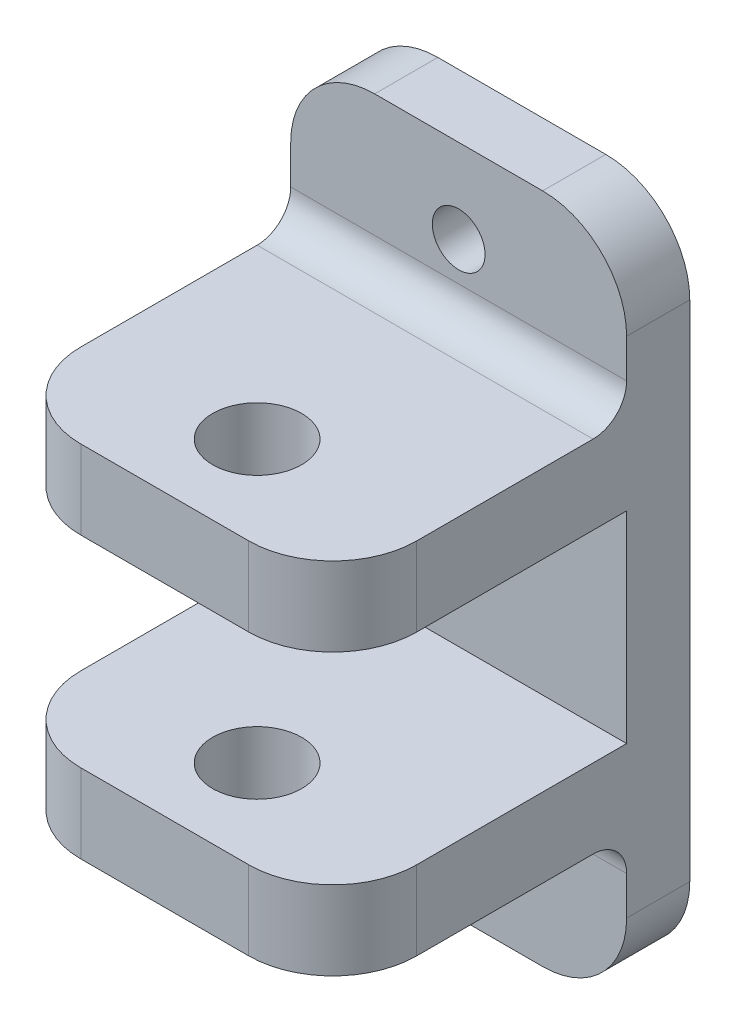
ISO-10303-21;
HEADER;
FILE_DESCRIPTION(('STEP AP214'),'2;1');
FILE_NAME('part.step','',(''),(''),'','','');
FILE_SCHEMA(('AUTOMOTIVE_DESIGN { 1 0 10303 214 1 1 1 1 }'));
ENDSEC;
DATA;
#1=APPLICATION_CONTEXT('core data for automotive mechanical design processes');
#2=APPLICATION_PROTOCOL_DEFINITION('international standard','automotive_design',2000,#1);
#3=PRODUCT_CONTEXT('',#1,'mechanical');
#4=PRODUCT('Part','Part','',(#3));
#5=PRODUCT_RELATED_PRODUCT_CATEGORY('part','',(#4));
#6=PRODUCT_DEFINITION_FORMATION('','',#4);
#7=PRODUCT_DEFINITION_CONTEXT('part definition',#1,'design');
#8=PRODUCT_DEFINITION('design','',#6,#7);
#9=PRODUCT_DEFINITION_SHAPE('','',#8);
#10=(LENGTH_UNIT() NAMED_UNIT(*) SI_UNIT(.MILLI.,.METRE.));
#11=(NAMED_UNIT(*) PLANE_ANGLE_UNIT() SI_UNIT($,.RADIAN.));
#12=(NAMED_UNIT(*) SI_UNIT($,.STERADIAN.) SOLID_ANGLE_UNIT());
#13=UNCERTAINTY_MEASURE_WITH_UNIT(LENGTH_MEASURE(1.E-05),#10,'distance_accuracy_value','');
#14=(GEOMETRIC_REPRESENTATION_CONTEXT(3) GLOBAL_UNCERTAINTY_ASSIGNED_CONTEXT((#13)) GLOBAL_UNIT_ASSIGNED_CONTEXT((#10,
#11,#12)) REPRESENTATION_CONTEXT('',''));
#15=CARTESIAN_POINT('',(0.,0.,0.));
#16=DIRECTION('',(0.,0.,1.));
#17=DIRECTION('',(1.,0.,0.));
#18=AXIS2_PLACEMENT_3D('',#15,#16,#17);
#19=CARTESIAN_POINT('',(0.,0.,4.7752));
#20=DIRECTION('',(0.,0.,1.));
#21=DIRECTION('',(0.,-1.,0.));
#22=AXIS2_PLACEMENT_3D('',#19,#20,#21);
#23=PLANE('',#22);
#24=DIRECTION('',(1.,0.,0.));
#25=VECTOR('',#24,1.);
#26=CARTESIAN_POINT('',(0.,24.13,4.7752));
#27=LINE('',#26,#25);
#28=CARTESIAN_POINT('',(-25.4,24.13,4.7752));
#29=VERTEX_POINT('',#28);
#30=CARTESIAN_POINT('',(0.,24.13,4.7752));
#31=VERTEX_POINT('',#30);
#32=EDGE_CURVE('E392',#29,#31,#27,.T.);
#33=ORIENTED_EDGE('',*,*,#32,.T.);
#34=DIRECTION('',(0.,-1.,0.));
#35=VECTOR('',#34,1.);
#36=CARTESIAN_POINT('',(0.,63.5,4.7752));
#37=LINE('',#36,#35);
#38=CARTESIAN_POINT('',(0.,39.37,4.7752));
#39=VERTEX_POINT('',#38);
#40=EDGE_CURVE('E355',#39,#31,#37,.T.);
#41=ORIENTED_EDGE('',*,*,#40,.F.);
#42=DIRECTION('',(-1.,0.,0.));
#43=VECTOR('',#42,1.);
#44=CARTESIAN_POINT('',(-12.7,39.37,4.7752));
#45=LINE('',#44,#43);
#46=CARTESIAN_POINT('',(-25.4,39.37,4.7752));
#47=VERTEX_POINT('',#46);
#48=EDGE_CURVE('E25',#39,#47,#45,.T.);
#49=ORIENTED_EDGE('',*,*,#48,.T.);
#50=DIRECTION('',(0.,1.,0.));
#51=VECTOR('',#50,1.);
#52=CARTESIAN_POINT('',(-25.4,63.5,4.7752));
#53=LINE('',#52,#51);
#54=EDGE_CURVE('E450',#29,#47,#53,.T.);
#55=ORIENTED_EDGE('',*,*,#54,.F.);
#56=EDGE_LOOP('',(#33,#41,#49,#55));
#57=FACE_BOUND('',#56,.T.);
#58=ADVANCED_FACE('F17',(#57),#23,.T.);
#59=CARTESIAN_POINT('',(-12.7,42.3545,27.0002));
#60=DIRECTION('',(0.,0.,1.));
#61=DIRECTION('',(1.,0.,0.));
#62=AXIS2_PLACEMENT_3D('',#59,#60,#61);
#63=PLANE('',#62);
#64=DIRECTION('',(0.,1.,0.));
#65=VECTOR('',#64,1.);
#66=CARTESIAN_POINT('',(-19.05,37.05225,27.0002));
#67=LINE('',#66,#65);
#68=CARTESIAN_POINT('',(-19.05,39.37,27.0002));
#69=VERTEX_POINT('',#68);
#70=CARTESIAN_POINT('',(-19.05,45.339,27.0002));
#71=VERTEX_POINT('',#70);
#72=EDGE_CURVE('E364',#69,#71,#67,.T.);
#73=ORIENTED_EDGE('',*,*,#72,.F.);
#74=DIRECTION('',(1.,0.,0.));
#75=VECTOR('',#74,1.);
#76=CARTESIAN_POINT('',(-25.4,39.37,27.0002));
#77=LINE('',#76,#75);
#78=CARTESIAN_POINT('',(-6.35,39.37,27.0002));
#79=VERTEX_POINT('',#78);
#80=EDGE_CURVE('E11',#69,#79,#77,.T.);
#81=ORIENTED_EDGE('',*,*,#80,.T.);
#82=DIRECTION('',(0.,-1.,0.));
#83=VECTOR('',#82,1.);
#84=CARTESIAN_POINT('',(-6.35,37.05225,27.0002));
#85=LINE('',#84,#83);
#86=CARTESIAN_POINT('',(-6.35,45.339,27.0002));
#87=VERTEX_POINT('',#86);
#88=EDGE_CURVE('E334',#87,#79,#85,.T.);
#89=ORIENTED_EDGE('',*,*,#88,.F.);
#90=DIRECTION('',(-1.,0.,0.));
#91=VECTOR('',#90,1.);
#92=CARTESIAN_POINT('',(0.,45.339,27.0002));
#93=LINE('',#92,#91);
#94=EDGE_CURVE('E347',#87,#71,#93,.T.);
#95=ORIENTED_EDGE('',*,*,#94,.T.);
#96=EDGE_LOOP('',(#73,#81,#89,#95));
#97=FACE_BOUND('',#96,.T.);
#98=ADVANCED_FACE('F608',(#97),#63,.T.);
#99=CARTESIAN_POINT('',(-25.4,39.37,4.7752));
#100=DIRECTION('',(0.,-1.,0.));
#101=DIRECTION('',(0.,0.,-1.));
#102=AXIS2_PLACEMENT_3D('',#99,#100,#101);
#103=PLANE('',#102);
#104=CARTESIAN_POINT('',(-12.7,39.37,20.0152));
#105=DIRECTION('',(0.,1.,0.));
#106=DIRECTION('',(1.,0.,0.));
#107=AXIS2_PLACEMENT_3D('',#104,#105,#106);
#108=CIRCLE('',#107,3.3655);
#109=CARTESIAN_POINT('',(-16.0655,39.37,20.0152));
#110=VERTEX_POINT('',#109);
#111=EDGE_CURVE('E45',#110,#110,#108,.T.);
#112=ORIENTED_EDGE('',*,*,#111,.T.);
#113=EDGE_LOOP('',(#112));
#114=FACE_BOUND('',#113,.T.);
#115=CARTESIAN_POINT('',(-19.05,39.37,20.6502));
#116=DIRECTION('',(0.,1.,0.));
#117=DIRECTION('',(-0.707106781186548,0.,0.707106781186547));
#118=AXIS2_PLACEMENT_3D('',#115,#116,#117);
#119=CIRCLE('',#118,6.35);
#120=CARTESIAN_POINT('',(-25.4,39.37,20.6502));
#121=VERTEX_POINT('',#120);
#122=EDGE_CURVE('E406',#121,#69,#119,.T.);
#123=ORIENTED_EDGE('',*,*,#122,.F.);
#124=DIRECTION('',(0.,0.,1.));
#125=VECTOR('',#124,1.);
#126=CARTESIAN_POINT('',(-25.4,39.37,4.7752));
#127=LINE('',#126,#125);
#128=EDGE_CURVE('E339',#47,#121,#127,.T.);
#129=ORIENTED_EDGE('',*,*,#128,.F.);
#130=ORIENTED_EDGE('',*,*,#48,.F.);
#131=DIRECTION('',(0.,0.,1.));
#132=VECTOR('',#131,1.);
#133=CARTESIAN_POINT('',(0.,39.37,4.7752));
#134=LINE('',#133,#132);
#135=CARTESIAN_POINT('',(0.,39.37,20.6502));
#136=VERTEX_POINT('',#135);
#137=EDGE_CURVE('E476',#39,#136,#134,.T.);
#138=ORIENTED_EDGE('',*,*,#137,.T.);
#139=CARTESIAN_POINT('',(-6.35,39.37,20.6502));
#140=DIRECTION('',(0.,1.,0.));
#141=DIRECTION('',(0.707106781186548,0.,0.707106781186547));
#142=AXIS2_PLACEMENT_3D('',#139,#140,#141);
#143=CIRCLE('',#142,6.35);
#144=EDGE_CURVE('E338',#79,#136,#143,.T.);
#145=ORIENTED_EDGE('',*,*,#144,.F.);
#146=ORIENTED_EDGE('',*,*,#80,.F.);
#147=EDGE_LOOP('',(#123,#129,#130,#138,#145,#146));
#148=FACE_BOUND('',#147,.T.);
#149=ADVANCED_FACE('F552',(#114,#148),#103,.T.);
#150=CARTESIAN_POINT('',(-12.7,21.1455,27.0002));
#151=DIRECTION('',(0.,0.,1.));
#152=DIRECTION('',(0.,-1.,0.));
#153=AXIS2_PLACEMENT_3D('',#150,#151,#152);
#154=PLANE('',#153);
#155=DIRECTION('',(0.,-1.,0.));
#156=VECTOR('',#155,1.);
#157=CARTESIAN_POINT('',(-6.35,26.44775,27.0002));
#158=LINE('',#157,#156);
#159=CARTESIAN_POINT('',(-6.35,24.13,27.0002));
#160=VERTEX_POINT('',#159);
#161=CARTESIAN_POINT('',(-6.35,18.161,27.0002));
#162=VERTEX_POINT('',#161);
#163=EDGE_CURVE('E418',#160,#162,#158,.T.);
#164=ORIENTED_EDGE('',*,*,#163,.F.);
#165=DIRECTION('',(-1.,0.,0.));
#166=VECTOR('',#165,1.);
#167=CARTESIAN_POINT('',(0.,24.13,27.0002));
#168=LINE('',#167,#166);
#169=CARTESIAN_POINT('',(-19.05,24.13,27.0002));
#170=VERTEX_POINT('',#169);
#171=EDGE_CURVE('E389',#160,#170,#168,.T.);
#172=ORIENTED_EDGE('',*,*,#171,.T.);
#173=DIRECTION('',(0.,1.,0.));
#174=VECTOR('',#173,1.);
#175=CARTESIAN_POINT('',(-19.05,26.44775,27.0002));
#176=LINE('',#175,#174);
#177=CARTESIAN_POINT('',(-19.05,18.161,27.0002));
#178=VERTEX_POINT('',#177);
#179=EDGE_CURVE('E421',#178,#170,#176,.T.);
#180=ORIENTED_EDGE('',*,*,#179,.F.);
#181=DIRECTION('',(1.,0.,0.));
#182=VECTOR('',#181,1.);
#183=CARTESIAN_POINT('',(-25.4,18.161,27.0002));
#184=LINE('',#183,#182);
#185=EDGE_CURVE('E297',#178,#162,#184,.T.);
#186=ORIENTED_EDGE('',*,*,#185,.T.);
#187=EDGE_LOOP('',(#164,#172,#180,#186));
#188=FACE_BOUND('',#187,.T.);
#189=ADVANCED_FACE('F564',(#188),#154,.T.);
#190=CARTESIAN_POINT('',(0.,24.13,4.7752));
#191=DIRECTION('',(0.,1.,0.));
#192=DIRECTION('',(0.,0.,-1.));
#193=AXIS2_PLACEMENT_3D('',#190,#191,#192);
#194=PLANE('',#193);
#195=CARTESIAN_POINT('',(-12.7,24.13,20.0152));
#196=DIRECTION('',(0.,-1.,0.));
#197=DIRECTION('',(1.,0.,0.));
#198=AXIS2_PLACEMENT_3D('',#195,#196,#197);
#199=CIRCLE('',#198,3.3655);
#200=CARTESIAN_POINT('',(-16.0655,24.13,20.0152));
#201=VERTEX_POINT('',#200);
#202=EDGE_CURVE('E290',#201,#201,#199,.T.);
#203=ORIENTED_EDGE('',*,*,#202,.T.);
#204=EDGE_LOOP('',(#203));
#205=FACE_BOUND('',#204,.T.);
#206=CARTESIAN_POINT('',(-6.35,24.13,20.6502));
#207=DIRECTION('',(0.,-1.,0.));
#208=DIRECTION('',(0.707106781186548,0.,0.707106781186547));
#209=AXIS2_PLACEMENT_3D('',#206,#207,#208);
#210=CIRCLE('',#209,6.35);
#211=CARTESIAN_POINT('',(0.,24.13,20.6502));
#212=VERTEX_POINT('',#211);
#213=EDGE_CURVE('E379',#212,#160,#210,.T.);
#214=ORIENTED_EDGE('',*,*,#213,.F.);
#215=DIRECTION('',(0.,0.,1.));
#216=VECTOR('',#215,1.);
#217=CARTESIAN_POINT('',(0.,24.13,4.7752));
#218=LINE('',#217,#216);
#219=EDGE_CURVE('E351',#31,#212,#218,.T.);
#220=ORIENTED_EDGE('',*,*,#219,.F.);
#221=ORIENTED_EDGE('',*,*,#32,.F.);
#222=DIRECTION('',(0.,0.,1.));
#223=VECTOR('',#222,1.);
#224=CARTESIAN_POINT('',(-25.4,24.13,4.7752));
#225=LINE('',#224,#223);
#226=CARTESIAN_POINT('',(-25.4,24.13,20.6502));
#227=VERTEX_POINT('',#226);
#228=EDGE_CURVE('E306',#29,#227,#225,.T.);
#229=ORIENTED_EDGE('',*,*,#228,.T.);
#230=CARTESIAN_POINT('',(-19.05,24.13,20.6502));
#231=DIRECTION('',(0.,-1.,0.));
#232=DIRECTION('',(-0.707106781186548,0.,0.707106781186547));
#233=AXIS2_PLACEMENT_3D('',#230,#231,#232);
#234=CIRCLE('',#233,6.35);
#235=EDGE_CURVE('E458',#170,#227,#234,.T.);
#236=ORIENTED_EDGE('',*,*,#235,.F.);
#237=ORIENTED_EDGE('',*,*,#171,.F.);
#238=EDGE_LOOP('',(#214,#220,#221,#229,#236,#237));
#239=FACE_BOUND('',#238,.T.);
#240=ADVANCED_FACE('F548',(#205,#239),#194,.T.);
#241=CARTESIAN_POINT('',(-12.7,50.8,4.7752));
#242=DIRECTION('',(0.,0.,-1.));
#243=DIRECTION('',(1.,0.,0.));
#244=AXIS2_PLACEMENT_3D('',#241,#242,#243);
#245=CYLINDRICAL_SURFACE('',#244,1.9939);
#246=CARTESIAN_POINT('',(-12.7,50.8,4.7752));
#247=DIRECTION('',(0.,0.,-1.));
#248=DIRECTION('',(1.,0.,0.));
#249=AXIS2_PLACEMENT_3D('',#246,#247,#248);
#250=CIRCLE('',#249,1.9939);
#251=CARTESIAN_POINT('',(-14.6939,50.8,4.7752));
#252=VERTEX_POINT('',#251);
#253=EDGE_CURVE('E430',#252,#252,#250,.T.);
#254=ORIENTED_EDGE('',*,*,#253,.F.);
#255=DIRECTION('',(0.,0.,-1.));
#256=VECTOR('',#255,1.);
#257=CARTESIAN_POINT('',(-14.6939,50.8,4.7752));
#258=LINE('',#257,#256);
#259=CARTESIAN_POINT('',(-14.6939,50.8,0.));
#260=VERTEX_POINT('',#259);
#261=EDGE_CURVE('E536',#252,#260,#258,.T.);
#262=ORIENTED_EDGE('',*,*,#261,.T.);
#263=CARTESIAN_POINT('',(-12.7,50.8,0.));
#264=DIRECTION('',(0.,0.,1.));
#265=DIRECTION('',(1.,0.,0.));
#266=AXIS2_PLACEMENT_3D('',#263,#264,#265);
#267=CIRCLE('',#266,1.9939);
#268=EDGE_CURVE('E457',#260,#260,#267,.T.);
#269=ORIENTED_EDGE('',*,*,#268,.F.);
#270=ORIENTED_EDGE('',*,*,#261,.F.);
#271=EDGE_LOOP('',(#254,#262,#269,#270));
#272=FACE_BOUND('',#271,.T.);
#273=ADVANCED_FACE('F646',(#272),#245,.F.);
#274=CARTESIAN_POINT('',(-12.7,12.7,4.7752));
#275=DIRECTION('',(0.,0.,-1.));
#276=DIRECTION('',(1.,0.,0.));
#277=AXIS2_PLACEMENT_3D('',#274,#275,#276);
#278=CYLINDRICAL_SURFACE('',#277,1.9939);
#279=CARTESIAN_POINT('',(-12.7,12.7,4.7752));
#280=DIRECTION('',(0.,0.,-1.));
#281=DIRECTION('',(1.,0.,0.));
#282=AXIS2_PLACEMENT_3D('',#279,#280,#281);
#283=CIRCLE('',#282,1.9939);
#284=CARTESIAN_POINT('',(-14.6939,12.7,4.7752));
#285=VERTEX_POINT('',#284);
#286=EDGE_CURVE('E451',#285,#285,#283,.T.);
#287=ORIENTED_EDGE('',*,*,#286,.F.);
#288=DIRECTION('',(0.,0.,-1.));
#289=VECTOR('',#288,1.);
#290=CARTESIAN_POINT('',(-14.6939,12.7,4.7752));
#291=LINE('',#290,#289);
#292=CARTESIAN_POINT('',(-14.6939,12.7,0.));
#293=VERTEX_POINT('',#292);
#294=EDGE_CURVE('E289',#285,#293,#291,.T.);
#295=ORIENTED_EDGE('',*,*,#294,.T.);
#296=CARTESIAN_POINT('',(-12.7,12.7,0.));
#297=DIRECTION('',(0.,0.,1.));
#298=DIRECTION('',(1.,0.,0.));
#299=AXIS2_PLACEMENT_3D('',#296,#297,#298);
#300=CIRCLE('',#299,1.9939);
#301=EDGE_CURVE('E514',#293,#293,#300,.T.);
#302=ORIENTED_EDGE('',*,*,#301,.F.);
#303=ORIENTED_EDGE('',*,*,#294,.F.);
#304=EDGE_LOOP('',(#287,#295,#302,#303));
#305=FACE_BOUND('',#304,.T.);
#306=ADVANCED_FACE('F648',(#305),#278,.F.);
#307=CARTESIAN_POINT('',(-12.7,45.339,20.0152));
#308=DIRECTION('',(0.,-1.,0.));
#309=DIRECTION('',(1.,0.,0.));
#310=AXIS2_PLACEMENT_3D('',#307,#308,#309);
#311=CYLINDRICAL_SURFACE('',#310,3.3655);
#312=ORIENTED_EDGE('',*,*,#202,.F.);
#313=DIRECTION('',(0.,-1.,0.));
#314=VECTOR('',#313,1.);
#315=CARTESIAN_POINT('',(-16.0655,45.339,20.0152));
#316=LINE('',#315,#314);
#317=CARTESIAN_POINT('',(-16.0655,18.161,20.0152));
#318=VERTEX_POINT('',#317);
#319=EDGE_CURVE('E37',#201,#318,#316,.T.);
#320=ORIENTED_EDGE('',*,*,#319,.T.);
#321=CARTESIAN_POINT('',(-12.7,18.161,20.0152));
#322=DIRECTION('',(0.,1.,0.));
#323=DIRECTION('',(1.,0.,0.));
#324=AXIS2_PLACEMENT_3D('',#321,#322,#323);
#325=CIRCLE('',#324,3.3655);
#326=EDGE_CURVE('E326',#318,#318,#325,.T.);
#327=ORIENTED_EDGE('',*,*,#326,.F.);
#328=ORIENTED_EDGE('',*,*,#319,.F.);
#329=EDGE_LOOP('',(#312,#320,#327,#328));
#330=FACE_BOUND('',#329,.T.);
#331=ADVANCED_FACE('F651',(#330),#311,.F.);
#332=CARTESIAN_POINT('',(-12.7,45.339,20.0152));
#333=DIRECTION('',(0.,-1.,0.));
#334=DIRECTION('',(1.,0.,0.));
#335=AXIS2_PLACEMENT_3D('',#332,#333,#334);
#336=CYLINDRICAL_SURFACE('',#335,3.3655);
#337=CARTESIAN_POINT('',(-12.7,45.339,20.0152));
#338=DIRECTION('',(0.,-1.,0.));
#339=DIRECTION('',(1.,0.,0.));
#340=AXIS2_PLACEMENT_3D('',#337,#338,#339);
#341=CIRCLE('',#340,3.3655);
#342=CARTESIAN_POINT('',(-16.0655,45.339,20.0152));
#343=VERTEX_POINT('',#342);
#344=EDGE_CURVE('E384',#343,#343,#341,.T.);
#345=ORIENTED_EDGE('',*,*,#344,.F.);
#346=DIRECTION('',(0.,-1.,0.));
#347=VECTOR('',#346,1.);
#348=CARTESIAN_POINT('',(-16.0655,45.339,20.0152));
#349=LINE('',#348,#347);
#350=EDGE_CURVE('E426',#343,#110,#349,.T.);
#351=ORIENTED_EDGE('',*,*,#350,.T.);
#352=ORIENTED_EDGE('',*,*,#111,.F.);
#353=ORIENTED_EDGE('',*,*,#350,.F.);
#354=EDGE_LOOP('',(#345,#351,#352,#353));
#355=FACE_BOUND('',#354,.T.);
#356=ADVANCED_FACE('F655',(#355),#336,.F.);
#357=CARTESIAN_POINT('',(0.,0.,4.7752));
#358=DIRECTION('',(0.,0.,1.));
#359=DIRECTION('',(0.,-1.,0.));
#360=AXIS2_PLACEMENT_3D('',#357,#358,#359);
#361=PLANE('',#360);
#362=ORIENTED_EDGE('',*,*,#253,.T.);
#363=EDGE_LOOP('',(#362));
#364=FACE_BOUND('',#363,.T.);
#365=DIRECTION('',(-1.,0.,0.));
#366=VECTOR('',#365,1.);
#367=CARTESIAN_POINT('',(0.,47.879,4.7752));
#368=LINE('',#367,#366);
#369=CARTESIAN_POINT('',(0.,47.879,4.7752));
#370=VERTEX_POINT('',#369);
#371=CARTESIAN_POINT('',(-25.4,47.879,4.7752));
#372=VERTEX_POINT('',#371);
#373=EDGE_CURVE('E315',#370,#372,#368,.T.);
#374=ORIENTED_EDGE('',*,*,#373,.F.);
#375=DIRECTION('',(0.,-1.,0.));
#376=VECTOR('',#375,1.);
#377=CARTESIAN_POINT('',(0.,63.5,4.7752));
#378=LINE('',#377,#376);
#379=CARTESIAN_POINT('',(0.,50.8,4.7752));
#380=VERTEX_POINT('',#379);
#381=EDGE_CURVE('E376',#380,#370,#378,.T.);
#382=ORIENTED_EDGE('',*,*,#381,.F.);
#383=CARTESIAN_POINT('',(-6.35,50.8,4.7752));
#384=DIRECTION('',(0.,0.,-1.));
#385=DIRECTION('',(0.707106781186548,0.707106781186547,0.));
#386=AXIS2_PLACEMENT_3D('',#383,#384,#385);
#387=CIRCLE('',#386,6.35);
#388=CARTESIAN_POINT('',(-6.35,57.15,4.7752));
#389=VERTEX_POINT('',#388);
#390=EDGE_CURVE('E287',#389,#380,#387,.T.);
#391=ORIENTED_EDGE('',*,*,#390,.F.);
#392=DIRECTION('',(-1.,0.,0.));
#393=VECTOR('',#392,1.);
#394=CARTESIAN_POINT('',(0.,57.15,4.7752));
#395=LINE('',#394,#393);
#396=CARTESIAN_POINT('',(-19.05,57.15,4.7752));
#397=VERTEX_POINT('',#396);
#398=EDGE_CURVE('E313',#389,#397,#395,.T.);
#399=ORIENTED_EDGE('',*,*,#398,.T.);
#400=CARTESIAN_POINT('',(-19.05,50.8,4.7752));
#401=DIRECTION('',(0.,0.,-1.));
#402=DIRECTION('',(-0.707106781186548,0.707106781186547,0.));
#403=AXIS2_PLACEMENT_3D('',#400,#401,#402);
#404=CIRCLE('',#403,6.35);
#405=CARTESIAN_POINT('',(-25.4,50.8,4.7752));
#406=VERTEX_POINT('',#405);
#407=EDGE_CURVE('E396',#406,#397,#404,.T.);
#408=ORIENTED_EDGE('',*,*,#407,.F.);
#409=DIRECTION('',(0.,1.,0.));
#410=VECTOR('',#409,1.);
#411=CARTESIAN_POINT('',(-25.4,63.5,4.7752));
#412=LINE('',#411,#410);
#413=EDGE_CURVE('E359',#372,#406,#412,.T.);
#414=ORIENTED_EDGE('',*,*,#413,.F.);
#415=EDGE_LOOP('',(#374,#382,#391,#399,#408,#414));
#416=FACE_BOUND('',#415,.T.);
#417=ADVANCED_FACE('F593',(#364,#416),#361,.T.);
#418=CARTESIAN_POINT('',(0.,0.,4.7752));
#419=DIRECTION('',(0.,0.,1.));
#420=DIRECTION('',(0.,-1.,0.));
#421=AXIS2_PLACEMENT_3D('',#418,#419,#420);
#422=PLANE('',#421);
#423=ORIENTED_EDGE('',*,*,#286,.T.);
#424=EDGE_LOOP('',(#423));
#425=FACE_BOUND('',#424,.T.);
#426=DIRECTION('',(1.,0.,0.));
#427=VECTOR('',#426,1.);
#428=CARTESIAN_POINT('',(-12.7,15.621,4.7752));
#429=LINE('',#428,#427);
#430=CARTESIAN_POINT('',(-25.4,15.621,4.7752));
#431=VERTEX_POINT('',#430);
#432=CARTESIAN_POINT('',(0.,15.621,4.7752));
#433=VERTEX_POINT('',#432);
#434=EDGE_CURVE('E251',#431,#433,#429,.T.);
#435=ORIENTED_EDGE('',*,*,#434,.F.);
#436=DIRECTION('',(0.,1.,0.));
#437=VECTOR('',#436,1.);
#438=CARTESIAN_POINT('',(-25.4,63.5,4.7752));
#439=LINE('',#438,#437);
#440=CARTESIAN_POINT('',(-25.4,12.7,4.7752));
#441=VERTEX_POINT('',#440);
#442=EDGE_CURVE('E307',#441,#431,#439,.T.);
#443=ORIENTED_EDGE('',*,*,#442,.F.);
#444=CARTESIAN_POINT('',(-19.05,12.7,4.7752));
#445=DIRECTION('',(0.,0.,-1.));
#446=DIRECTION('',(-0.707106781186547,-0.707106781186548,0.));
#447=AXIS2_PLACEMENT_3D('',#444,#445,#446);
#448=CIRCLE('',#447,6.35);
#449=CARTESIAN_POINT('',(-19.05,6.35,4.7752));
#450=VERTEX_POINT('',#449);
#451=EDGE_CURVE('E435',#450,#441,#448,.T.);
#452=ORIENTED_EDGE('',*,*,#451,.F.);
#453=DIRECTION('',(1.,0.,0.));
#454=VECTOR('',#453,1.);
#455=CARTESIAN_POINT('',(-12.7,6.35,4.7752));
#456=LINE('',#455,#454);
#457=CARTESIAN_POINT('',(-6.35,6.35,4.7752));
#458=VERTEX_POINT('',#457);
#459=EDGE_CURVE('E310',#450,#458,#456,.T.);
#460=ORIENTED_EDGE('',*,*,#459,.T.);
#461=CARTESIAN_POINT('',(-6.35,12.7,4.7752));
#462=DIRECTION('',(0.,0.,-1.));
#463=DIRECTION('',(0.707106781186547,-0.707106781186548,0.));
#464=AXIS2_PLACEMENT_3D('',#461,#462,#463);
#465=CIRCLE('',#464,6.35);
#466=CARTESIAN_POINT('',(0.,12.7,4.7752));
#467=VERTEX_POINT('',#466);
#468=EDGE_CURVE('E254',#467,#458,#465,.T.);
#469=ORIENTED_EDGE('',*,*,#468,.F.);
#470=DIRECTION('',(0.,-1.,0.));
#471=VECTOR('',#470,1.);
#472=CARTESIAN_POINT('',(0.,63.5,4.7752));
#473=LINE('',#472,#471);
#474=EDGE_CURVE('E247',#433,#467,#473,.T.);
#475=ORIENTED_EDGE('',*,*,#474,.F.);
#476=EDGE_LOOP('',(#435,#443,#452,#460,#469,#475));
#477=FACE_BOUND('',#476,.T.);
#478=ADVANCED_FACE('F249',(#425,#477),#422,.T.);
#479=CARTESIAN_POINT('',(0.,57.15,4.7752));
#480=DIRECTION('',(0.,-1.,0.));
#481=DIRECTION('',(0.,0.,-1.));
#482=AXIS2_PLACEMENT_3D('',#479,#480,#481);
#483=PLANE('',#482);
#484=DIRECTION('',(0.,0.,-1.));
#485=VECTOR('',#484,1.);
#486=CARTESIAN_POINT('',(-19.05,57.15,3.5814));
#487=LINE('',#486,#485);
#488=CARTESIAN_POINT('',(-19.05,57.15,0.));
#489=VERTEX_POINT('',#488);
#490=EDGE_CURVE('E393',#397,#489,#487,.T.);
#491=ORIENTED_EDGE('',*,*,#490,.F.);
#492=ORIENTED_EDGE('',*,*,#398,.F.);
#493=DIRECTION('',(0.,0.,1.));
#494=VECTOR('',#493,1.);
#495=CARTESIAN_POINT('',(-6.35,57.15,3.5814));
#496=LINE('',#495,#494);
#497=CARTESIAN_POINT('',(-6.35,57.15,0.));
#498=VERTEX_POINT('',#497);
#499=EDGE_CURVE('E314',#498,#389,#496,.T.);
#500=ORIENTED_EDGE('',*,*,#499,.F.);
#501=DIRECTION('',(1.,0.,0.));
#502=VECTOR('',#501,1.);
#503=CARTESIAN_POINT('',(0.,57.15,0.));
#504=LINE('',#503,#502);
#505=EDGE_CURVE('E467',#489,#498,#504,.T.);
#506=ORIENTED_EDGE('',*,*,#505,.F.);
#507=EDGE_LOOP('',(#491,#492,#500,#506));
#508=FACE_BOUND('',#507,.T.);
#509=ADVANCED_FACE('F617',(#508),#483,.F.);
#510=CARTESIAN_POINT('',(-25.4,6.35,4.7752));
#511=DIRECTION('',(0.,1.,0.));
#512=DIRECTION('',(0.,0.,-1.));
#513=AXIS2_PLACEMENT_3D('',#510,#511,#512);
#514=PLANE('',#513);
#515=DIRECTION('',(0.,0.,-1.));
#516=VECTOR('',#515,1.);
#517=CARTESIAN_POINT('',(-6.35,6.35,3.5814));
#518=LINE('',#517,#516);
#519=CARTESIAN_POINT('',(-6.35,6.35,0.));
#520=VERTEX_POINT('',#519);
#521=EDGE_CURVE('E402',#458,#520,#518,.T.);
#522=ORIENTED_EDGE('',*,*,#521,.F.);
#523=ORIENTED_EDGE('',*,*,#459,.F.);
#524=DIRECTION('',(0.,0.,1.));
#525=VECTOR('',#524,1.);
#526=CARTESIAN_POINT('',(-19.05,6.35,3.5814));
#527=LINE('',#526,#525);
#528=CARTESIAN_POINT('',(-19.05,6.35,0.));
#529=VERTEX_POINT('',#528);
#530=EDGE_CURVE('E431',#529,#450,#527,.T.);
#531=ORIENTED_EDGE('',*,*,#530,.F.);
#532=DIRECTION('',(-1.,0.,0.));
#533=VECTOR('',#532,1.);
#534=CARTESIAN_POINT('',(-12.7,6.35,0.));
#535=LINE('',#534,#533);
#536=EDGE_CURVE('E397',#520,#529,#535,.T.);
#537=ORIENTED_EDGE('',*,*,#536,.F.);
#538=EDGE_LOOP('',(#522,#523,#531,#537));
#539=FACE_BOUND('',#538,.T.);
#540=ADVANCED_FACE('F576',(#539),#514,.F.);
#541=CARTESIAN_POINT('',(-6.35,50.8,3.5814));
#542=DIRECTION('',(0.,0.,1.));
#543=DIRECTION('',(0.707106781186548,0.707106781186547,0.));
#544=AXIS2_PLACEMENT_3D('',#541,#542,#543);
#545=CYLINDRICAL_SURFACE('',#544,6.35);
#546=ORIENTED_EDGE('',*,*,#390,.T.);
#547=DIRECTION('',(0.,0.,-1.));
#548=VECTOR('',#547,1.);
#549=CARTESIAN_POINT('',(0.,50.8,3.5814));
#550=LINE('',#549,#548);
#551=CARTESIAN_POINT('',(0.,50.8,0.));
#552=VERTEX_POINT('',#551);
#553=EDGE_CURVE('E380',#380,#552,#550,.T.);
#554=ORIENTED_EDGE('',*,*,#553,.T.);
#555=CARTESIAN_POINT('',(-6.35,50.8,0.));
#556=DIRECTION('',(0.,0.,1.));
#557=DIRECTION('',(0.707106781186548,0.707106781186547,0.));
#558=AXIS2_PLACEMENT_3D('',#555,#556,#557);
#559=CIRCLE('',#558,6.35);
#560=EDGE_CURVE('E471',#552,#498,#559,.T.);
#561=ORIENTED_EDGE('',*,*,#560,.T.);
#562=ORIENTED_EDGE('',*,*,#499,.T.);
#563=EDGE_LOOP('',(#546,#554,#561,#562));
#564=FACE_BOUND('',#563,.T.);
#565=ADVANCED_FACE('F587',(#564),#545,.T.);
#566=CARTESIAN_POINT('',(-19.05,50.8,3.5814));
#567=DIRECTION('',(0.,0.,-1.));
#568=DIRECTION('',(-0.707106781186548,0.707106781186547,0.));
#569=AXIS2_PLACEMENT_3D('',#566,#567,#568);
#570=CYLINDRICAL_SURFACE('',#569,6.35);
#571=CARTESIAN_POINT('',(-19.05,50.8,0.));
#572=DIRECTION('',(0.,0.,1.));
#573=DIRECTION('',(-0.707106781186548,0.707106781186547,0.));
#574=AXIS2_PLACEMENT_3D('',#571,#572,#573);
#575=CIRCLE('',#574,6.35);
#576=CARTESIAN_POINT('',(-25.4,50.8,0.));
#577=VERTEX_POINT('',#576);
#578=EDGE_CURVE('E472',#489,#577,#575,.T.);
#579=ORIENTED_EDGE('',*,*,#578,.T.);
#580=DIRECTION('',(0.,0.,1.));
#581=VECTOR('',#580,1.);
#582=CARTESIAN_POINT('',(-25.4,50.8,3.5814));
#583=LINE('',#582,#581);
#584=EDGE_CURVE('E363',#577,#406,#583,.T.);
#585=ORIENTED_EDGE('',*,*,#584,.T.);
#586=ORIENTED_EDGE('',*,*,#407,.T.);
#587=ORIENTED_EDGE('',*,*,#490,.T.);
#588=EDGE_LOOP('',(#579,#585,#586,#587));
#589=FACE_BOUND('',#588,.T.);
#590=ADVANCED_FACE('F614',(#589),#570,.T.);
#591=CARTESIAN_POINT('',(-19.05,12.7,3.5814));
#592=DIRECTION('',(0.,0.,1.));
#593=DIRECTION('',(-0.707106781186547,-0.707106781186548,0.));
#594=AXIS2_PLACEMENT_3D('',#591,#592,#593);
#595=CYLINDRICAL_SURFACE('',#594,6.35);
#596=ORIENTED_EDGE('',*,*,#451,.T.);
#597=DIRECTION('',(0.,0.,-1.));
#598=VECTOR('',#597,1.);
#599=CARTESIAN_POINT('',(-25.4,12.7,3.5814));
#600=LINE('',#599,#598);
#601=CARTESIAN_POINT('',(-25.4,12.7,0.));
#602=VERTEX_POINT('',#601);
#603=EDGE_CURVE('E425',#441,#602,#600,.T.);
#604=ORIENTED_EDGE('',*,*,#603,.T.);
#605=CARTESIAN_POINT('',(-19.05,12.7,0.));
#606=DIRECTION('',(0.,0.,1.));
#607=DIRECTION('',(-0.707106781186547,-0.707106781186548,0.));
#608=AXIS2_PLACEMENT_3D('',#605,#606,#607);
#609=CIRCLE('',#608,6.35);
#610=EDGE_CURVE('E401',#602,#529,#609,.T.);
#611=ORIENTED_EDGE('',*,*,#610,.T.);
#612=ORIENTED_EDGE('',*,*,#530,.T.);
#613=EDGE_LOOP('',(#596,#604,#611,#612));
#614=FACE_BOUND('',#613,.T.);
#615=ADVANCED_FACE('F574',(#614),#595,.T.);
#616=CARTESIAN_POINT('',(0.,63.5,0.));
#617=DIRECTION('',(0.,0.,-1.));
#618=DIRECTION('',(-1.,0.,0.));
#619=AXIS2_PLACEMENT_3D('',#616,#617,#618);
#620=PLANE('',#619);
#621=ORIENTED_EDGE('',*,*,#268,.T.);
#622=EDGE_LOOP('',(#621));
#623=FACE_BOUND('',#622,.T.);
#624=ORIENTED_EDGE('',*,*,#301,.T.);
#625=EDGE_LOOP('',(#624));
#626=FACE_BOUND('',#625,.T.);
#627=CARTESIAN_POINT('',(-6.35,12.7,0.));
#628=DIRECTION('',(0.,0.,1.));
#629=DIRECTION('',(0.707106781186547,-0.707106781186548,0.));
#630=AXIS2_PLACEMENT_3D('',#627,#628,#629);
#631=CIRCLE('',#630,6.35);
#632=CARTESIAN_POINT('',(0.,12.7,0.));
#633=VERTEX_POINT('',#632);
#634=EDGE_CURVE('E461',#520,#633,#631,.T.);
#635=ORIENTED_EDGE('',*,*,#634,.F.);
#636=ORIENTED_EDGE('',*,*,#536,.T.);
#637=ORIENTED_EDGE('',*,*,#610,.F.);
#638=DIRECTION('',(0.,-1.,0.));
#639=VECTOR('',#638,1.);
#640=CARTESIAN_POINT('',(-25.4,0.,0.));
#641=LINE('',#640,#639);
#642=EDGE_CURVE('E417',#577,#602,#641,.T.);
#643=ORIENTED_EDGE('',*,*,#642,.F.);
#644=ORIENTED_EDGE('',*,*,#578,.F.);
#645=ORIENTED_EDGE('',*,*,#505,.T.);
#646=ORIENTED_EDGE('',*,*,#560,.F.);
#647=DIRECTION('',(0.,1.,0.));
#648=VECTOR('',#647,1.);
#649=CARTESIAN_POINT('',(0.,0.,0.));
#650=LINE('',#649,#648);
#651=EDGE_CURVE('E439',#633,#552,#650,.T.);
#652=ORIENTED_EDGE('',*,*,#651,.F.);
#653=EDGE_LOOP('',(#635,#636,#637,#643,#644,#645,#646,#652));
#654=FACE_BOUND('',#653,.T.);
#655=ADVANCED_FACE('F583',(#623,#626,#654),#620,.T.);
#656=CARTESIAN_POINT('',(-6.35,12.7,3.5814));
#657=DIRECTION('',(0.,0.,-1.));
#658=DIRECTION('',(0.707106781186547,-0.707106781186548,0.));
#659=AXIS2_PLACEMENT_3D('',#656,#657,#658);
#660=CYLINDRICAL_SURFACE('',#659,6.35);
#661=ORIENTED_EDGE('',*,*,#634,.T.);
#662=DIRECTION('',(0.,0.,1.));
#663=VECTOR('',#662,1.);
#664=CARTESIAN_POINT('',(0.,12.7,3.5814));
#665=LINE('',#664,#663);
#666=EDGE_CURVE('E260',#633,#467,#665,.T.);
#667=ORIENTED_EDGE('',*,*,#666,.T.);
#668=ORIENTED_EDGE('',*,*,#468,.T.);
#669=ORIENTED_EDGE('',*,*,#521,.T.);
#670=EDGE_LOOP('',(#661,#667,#668,#669));
#671=FACE_BOUND('',#670,.T.);
#672=ADVANCED_FACE('F579',(#671),#660,.T.);
#673=CARTESIAN_POINT('',(-19.05,26.44775,20.6502));
#674=DIRECTION('',(0.,-1.,0.));
#675=DIRECTION('',(-0.707106781186548,0.,0.707106781186547));
#676=AXIS2_PLACEMENT_3D('',#673,#674,#675);
#677=CYLINDRICAL_SURFACE('',#676,6.35);
#678=CARTESIAN_POINT('',(-19.05,18.161,20.6502));
#679=DIRECTION('',(0.,1.,0.));
#680=DIRECTION('',(-0.707106781186548,0.,0.707106781186547));
#681=AXIS2_PLACEMENT_3D('',#678,#679,#680);
#682=CIRCLE('',#681,6.35);
#683=CARTESIAN_POINT('',(-25.4,18.161,20.6502));
#684=VERTEX_POINT('',#683);
#685=EDGE_CURVE('E302',#684,#178,#682,.T.);
#686=ORIENTED_EDGE('',*,*,#685,.T.);
#687=ORIENTED_EDGE('',*,*,#179,.T.);
#688=ORIENTED_EDGE('',*,*,#235,.T.);
#689=DIRECTION('',(0.,-1.,0.));
#690=VECTOR('',#689,1.);
#691=CARTESIAN_POINT('',(-25.4,26.44775,20.6502));
#692=LINE('',#691,#690);
#693=EDGE_CURVE('E303',#227,#684,#692,.T.);
#694=ORIENTED_EDGE('',*,*,#693,.T.);
#695=EDGE_LOOP('',(#686,#687,#688,#694));
#696=FACE_BOUND('',#695,.T.);
#697=ADVANCED_FACE('F560',(#696),#677,.T.);
#698=CARTESIAN_POINT('',(-6.35,26.44775,20.6502));
#699=DIRECTION('',(0.,1.,0.));
#700=DIRECTION('',(0.707106781186548,0.,0.707106781186547));
#701=AXIS2_PLACEMENT_3D('',#698,#699,#700);
#702=CYLINDRICAL_SURFACE('',#701,6.35);
#703=CARTESIAN_POINT('',(-6.35,18.161,20.6502));
#704=DIRECTION('',(0.,1.,0.));
#705=DIRECTION('',(0.707106781186548,0.,0.707106781186547));
#706=AXIS2_PLACEMENT_3D('',#703,#704,#705);
#707=CIRCLE('',#706,6.35);
#708=CARTESIAN_POINT('',(0.,18.161,20.6502));
#709=VERTEX_POINT('',#708);
#710=EDGE_CURVE('E294',#162,#709,#707,.T.);
#711=ORIENTED_EDGE('',*,*,#710,.T.);
#712=DIRECTION('',(0.,1.,0.));
#713=VECTOR('',#712,1.);
#714=CARTESIAN_POINT('',(0.,26.44775,20.6502));
#715=LINE('',#714,#713);
#716=EDGE_CURVE('E261',#709,#212,#715,.T.);
#717=ORIENTED_EDGE('',*,*,#716,.T.);
#718=ORIENTED_EDGE('',*,*,#213,.T.);
#719=ORIENTED_EDGE('',*,*,#163,.T.);
#720=EDGE_LOOP('',(#711,#717,#718,#719));
#721=FACE_BOUND('',#720,.T.);
#722=ADVANCED_FACE('F567',(#721),#702,.T.);
#723=CARTESIAN_POINT('',(0.,31.75,2.3876));
#724=DIRECTION('',(1.,0.,0.));
#725=DIRECTION('',(0.,1.,0.));
#726=AXIS2_PLACEMENT_3D('',#723,#724,#725);
#727=PLANE('',#726);
#728=DIRECTION('',(0.,1.,0.));
#729=VECTOR('',#728,1.);
#730=CARTESIAN_POINT('',(0.,37.05225,20.6502));
#731=LINE('',#730,#729);
#732=CARTESIAN_POINT('',(0.,45.339,20.6502));
#733=VERTEX_POINT('',#732);
#734=EDGE_CURVE('E480',#136,#733,#731,.T.);
#735=ORIENTED_EDGE('',*,*,#734,.F.);
#736=ORIENTED_EDGE('',*,*,#137,.F.);
#737=ORIENTED_EDGE('',*,*,#40,.T.);
#738=ORIENTED_EDGE('',*,*,#219,.T.);
#739=ORIENTED_EDGE('',*,*,#716,.F.);
#740=DIRECTION('',(0.,0.,1.));
#741=VECTOR('',#740,1.);
#742=CARTESIAN_POINT('',(0.,18.161,4.7752));
#743=LINE('',#742,#741);
#744=CARTESIAN_POINT('',(0.,18.161,7.3152));
#745=VERTEX_POINT('',#744);
#746=EDGE_CURVE('E271',#745,#709,#743,.T.);
#747=ORIENTED_EDGE('',*,*,#746,.F.);
#748=CARTESIAN_POINT('',(0.,15.621,7.3152));
#749=DIRECTION('',(1.,0.,0.));
#750=DIRECTION('',(0.,0.707106781186548,-0.707106781186548));
#751=AXIS2_PLACEMENT_3D('',#748,#749,#750);
#752=CIRCLE('',#751,2.54);
#753=EDGE_CURVE('E267',#433,#745,#752,.T.);
#754=ORIENTED_EDGE('',*,*,#753,.F.);
#755=ORIENTED_EDGE('',*,*,#474,.T.);
#756=ORIENTED_EDGE('',*,*,#666,.F.);
#757=ORIENTED_EDGE('',*,*,#651,.T.);
#758=ORIENTED_EDGE('',*,*,#553,.F.);
#759=ORIENTED_EDGE('',*,*,#381,.T.);
#760=CARTESIAN_POINT('',(0.,47.879,7.3152));
#761=DIRECTION('',(1.,0.,0.));
#762=DIRECTION('',(0.,-0.707106781186549,-0.707106781186546));
#763=AXIS2_PLACEMENT_3D('',#760,#761,#762);
#764=CIRCLE('',#763,2.54);
#765=CARTESIAN_POINT('',(0.,45.339,7.3152));
#766=VERTEX_POINT('',#765);
#767=EDGE_CURVE('E320',#766,#370,#764,.T.);
#768=ORIENTED_EDGE('',*,*,#767,.F.);
#769=DIRECTION('',(0.,0.,1.));
#770=VECTOR('',#769,1.);
#771=CARTESIAN_POINT('',(0.,45.339,4.7752));
#772=LINE('',#771,#770);
#773=EDGE_CURVE('E375',#766,#733,#772,.T.);
#774=ORIENTED_EDGE('',*,*,#773,.T.);
#775=EDGE_LOOP('',(#735,#736,#737,#738,#739,#747,#754,#755,#756,#757,#758,#759,#768,#774));
#776=FACE_BOUND('',#775,.T.);
#777=ADVANCED_FACE('F274',(#776),#727,.T.);
#778=CARTESIAN_POINT('',(-6.35,37.05225,20.6502));
#779=DIRECTION('',(0.,1.,0.));
#780=DIRECTION('',(0.707106781186548,0.,0.707106781186547));
#781=AXIS2_PLACEMENT_3D('',#778,#779,#780);
#782=CYLINDRICAL_SURFACE('',#781,6.35);
#783=CARTESIAN_POINT('',(-6.35,45.339,20.6502));
#784=DIRECTION('',(0.,-1.,0.));
#785=DIRECTION('',(0.707106781186548,0.,0.707106781186547));
#786=AXIS2_PLACEMENT_3D('',#783,#784,#785);
#787=CIRCLE('',#786,6.35);
#788=EDGE_CURVE('E371',#733,#87,#787,.T.);
#789=ORIENTED_EDGE('',*,*,#788,.T.);
#790=ORIENTED_EDGE('',*,*,#88,.T.);
#791=ORIENTED_EDGE('',*,*,#144,.T.);
#792=ORIENTED_EDGE('',*,*,#734,.T.);
#793=EDGE_LOOP('',(#789,#790,#791,#792));
#794=FACE_BOUND('',#793,.T.);
#795=ADVANCED_FACE('F605',(#794),#782,.T.);
#796=CARTESIAN_POINT('',(-25.4,31.75,2.3876));
#797=DIRECTION('',(-1.,0.,0.));
#798=DIRECTION('',(0.,0.,1.));
#799=AXIS2_PLACEMENT_3D('',#796,#797,#798);
#800=PLANE('',#799);
#801=DIRECTION('',(0.,-1.,0.));
#802=VECTOR('',#801,1.);
#803=CARTESIAN_POINT('',(-25.4,37.05225,20.6502));
#804=LINE('',#803,#802);
#805=CARTESIAN_POINT('',(-25.4,45.339,20.6502));
#806=VERTEX_POINT('',#805);
#807=EDGE_CURVE('E388',#806,#121,#804,.T.);
#808=ORIENTED_EDGE('',*,*,#807,.F.);
#809=DIRECTION('',(0.,0.,1.));
#810=VECTOR('',#809,1.);
#811=CARTESIAN_POINT('',(-25.4,45.339,4.7752));
#812=LINE('',#811,#810);
#813=CARTESIAN_POINT('',(-25.4,45.339,7.3152));
#814=VERTEX_POINT('',#813);
#815=EDGE_CURVE('E319',#814,#806,#812,.T.);
#816=ORIENTED_EDGE('',*,*,#815,.F.);
#817=CARTESIAN_POINT('',(-25.4,47.879,7.3152));
#818=DIRECTION('',(-1.,0.,0.));
#819=DIRECTION('',(0.,-0.707106781186549,-0.707106781186546));
#820=AXIS2_PLACEMENT_3D('',#817,#818,#819);
#821=CIRCLE('',#820,2.54);
#822=EDGE_CURVE('E321',#372,#814,#821,.T.);
#823=ORIENTED_EDGE('',*,*,#822,.F.);
#824=ORIENTED_EDGE('',*,*,#413,.T.);
#825=ORIENTED_EDGE('',*,*,#584,.F.);
#826=ORIENTED_EDGE('',*,*,#642,.T.);
#827=ORIENTED_EDGE('',*,*,#603,.F.);
#828=ORIENTED_EDGE('',*,*,#442,.T.);
#829=CARTESIAN_POINT('',(-25.4,15.621,7.3152));
#830=DIRECTION('',(-1.,0.,0.));
#831=DIRECTION('',(0.,0.707106781186548,-0.707106781186548));
#832=AXIS2_PLACEMENT_3D('',#829,#830,#831);
#833=CIRCLE('',#832,2.54);
#834=CARTESIAN_POINT('',(-25.4,18.161,7.3152));
#835=VERTEX_POINT('',#834);
#836=EDGE_CURVE('E269',#835,#431,#833,.T.);
#837=ORIENTED_EDGE('',*,*,#836,.F.);
#838=DIRECTION('',(0.,0.,1.));
#839=VECTOR('',#838,1.);
#840=CARTESIAN_POINT('',(-25.4,18.161,4.7752));
#841=LINE('',#840,#839);
#842=EDGE_CURVE('E330',#835,#684,#841,.T.);
#843=ORIENTED_EDGE('',*,*,#842,.T.);
#844=ORIENTED_EDGE('',*,*,#693,.F.);
#845=ORIENTED_EDGE('',*,*,#228,.F.);
#846=ORIENTED_EDGE('',*,*,#54,.T.);
#847=ORIENTED_EDGE('',*,*,#128,.T.);
#848=EDGE_LOOP('',(#808,#816,#823,#824,#825,#826,#827,#828,#837,#843,#844,#845,#846,#847));
#849=FACE_BOUND('',#848,.T.);
#850=ADVANCED_FACE('F555',(#849),#800,.T.);
#851=CARTESIAN_POINT('',(-19.05,37.05225,20.6502));
#852=DIRECTION('',(0.,-1.,0.));
#853=DIRECTION('',(-0.707106781186548,0.,0.707106781186547));
#854=AXIS2_PLACEMENT_3D('',#851,#852,#853);
#855=CYLINDRICAL_SURFACE('',#854,6.35);
#856=CARTESIAN_POINT('',(-19.05,45.339,20.6502));
#857=DIRECTION('',(0.,-1.,0.));
#858=DIRECTION('',(-0.707106781186548,0.,0.707106781186547));
#859=AXIS2_PLACEMENT_3D('',#856,#857,#858);
#860=CIRCLE('',#859,6.35);
#861=EDGE_CURVE('E343',#71,#806,#860,.T.);
#862=ORIENTED_EDGE('',*,*,#861,.T.);
#863=ORIENTED_EDGE('',*,*,#807,.T.);
#864=ORIENTED_EDGE('',*,*,#122,.T.);
#865=ORIENTED_EDGE('',*,*,#72,.T.);
#866=EDGE_LOOP('',(#862,#863,#864,#865));
#867=FACE_BOUND('',#866,.T.);
#868=ADVANCED_FACE('F610',(#867),#855,.T.);
#869=CARTESIAN_POINT('',(0.,45.339,4.7752));
#870=DIRECTION('',(0.,1.,0.));
#871=DIRECTION('',(1.,0.,0.));
#872=AXIS2_PLACEMENT_3D('',#869,#870,#871);
#873=PLANE('',#872);
#874=ORIENTED_EDGE('',*,*,#344,.T.);
#875=EDGE_LOOP('',(#874));
#876=FACE_BOUND('',#875,.T.);
#877=DIRECTION('',(1.,0.,0.));
#878=VECTOR('',#877,1.);
#879=CARTESIAN_POINT('',(0.,45.339,7.3152));
#880=LINE('',#879,#878);
#881=EDGE_CURVE('E325',#814,#766,#880,.T.);
#882=ORIENTED_EDGE('',*,*,#881,.F.);
#883=ORIENTED_EDGE('',*,*,#815,.T.);
#884=ORIENTED_EDGE('',*,*,#861,.F.);
#885=ORIENTED_EDGE('',*,*,#94,.F.);
#886=ORIENTED_EDGE('',*,*,#788,.F.);
#887=ORIENTED_EDGE('',*,*,#773,.F.);
#888=EDGE_LOOP('',(#882,#883,#884,#885,#886,#887));
#889=FACE_BOUND('',#888,.T.);
#890=ADVANCED_FACE('F601',(#876,#889),#873,.T.);
#891=CARTESIAN_POINT('',(0.,47.879,7.3152));
#892=DIRECTION('',(1.,0.,0.));
#893=DIRECTION('',(0.,-0.707106781186549,-0.707106781186546));
#894=AXIS2_PLACEMENT_3D('',#891,#892,#893);
#895=CYLINDRICAL_SURFACE('',#894,2.54);
#896=ORIENTED_EDGE('',*,*,#822,.T.);
#897=ORIENTED_EDGE('',*,*,#881,.T.);
#898=ORIENTED_EDGE('',*,*,#767,.T.);
#899=ORIENTED_EDGE('',*,*,#373,.T.);
#900=EDGE_LOOP('',(#896,#897,#898,#899));
#901=FACE_BOUND('',#900,.T.);
#902=ADVANCED_FACE('F598',(#901),#895,.F.);
#903=CARTESIAN_POINT('',(-25.4,18.161,4.7752));
#904=DIRECTION('',(0.,-1.,0.));
#905=DIRECTION('',(0.,0.,-1.));
#906=AXIS2_PLACEMENT_3D('',#903,#904,#905);
#907=PLANE('',#906);
#908=ORIENTED_EDGE('',*,*,#326,.T.);
#909=EDGE_LOOP('',(#908));
#910=FACE_BOUND('',#909,.T.);
#911=DIRECTION('',(-1.,0.,0.));
#912=VECTOR('',#911,1.);
#913=CARTESIAN_POINT('',(-12.7,18.161,7.3152));
#914=LINE('',#913,#912);
#915=EDGE_CURVE('E278',#745,#835,#914,.T.);
#916=ORIENTED_EDGE('',*,*,#915,.F.);
#917=ORIENTED_EDGE('',*,*,#746,.T.);
#918=ORIENTED_EDGE('',*,*,#710,.F.);
#919=ORIENTED_EDGE('',*,*,#185,.F.);
#920=ORIENTED_EDGE('',*,*,#685,.F.);
#921=ORIENTED_EDGE('',*,*,#842,.F.);
#922=EDGE_LOOP('',(#916,#917,#918,#919,#920,#921));
#923=FACE_BOUND('',#922,.T.);
#924=ADVANCED_FACE('F569',(#910,#923),#907,.T.);
#925=CARTESIAN_POINT('',(-12.7,15.621,7.3152));
#926=DIRECTION('',(-1.,0.,0.));
#927=DIRECTION('',(0.,0.707106781186548,-0.707106781186548));
#928=AXIS2_PLACEMENT_3D('',#925,#926,#927);
#929=CYLINDRICAL_SURFACE('',#928,2.54);
#930=ORIENTED_EDGE('',*,*,#753,.T.);
#931=ORIENTED_EDGE('',*,*,#915,.T.);
#932=ORIENTED_EDGE('',*,*,#836,.T.);
#933=ORIENTED_EDGE('',*,*,#434,.T.);
#934=EDGE_LOOP('',(#930,#931,#932,#933));
#935=FACE_BOUND('',#934,.T.);
#936=ADVANCED_FACE('F265',(#935),#929,.F.);
#937=CLOSED_SHELL('',(#58,#98,#149,#189,#240,#273,#306,#331,#356,#417,#478,#509,#540,#565,#590,
#615,#655,#672,#697,#722,#777,#795,#850,#868,#890,#902,#924,#936));
#938=MANIFOLD_SOLID_BREP('B1',#937);
#939=ADVANCED_BREP_SHAPE_REPRESENTATION('',(#18,#938),#14);
#940=SHAPE_DEFINITION_REPRESENTATION(#9,#939);
ENDSEC;
END-ISO-10303-21;
